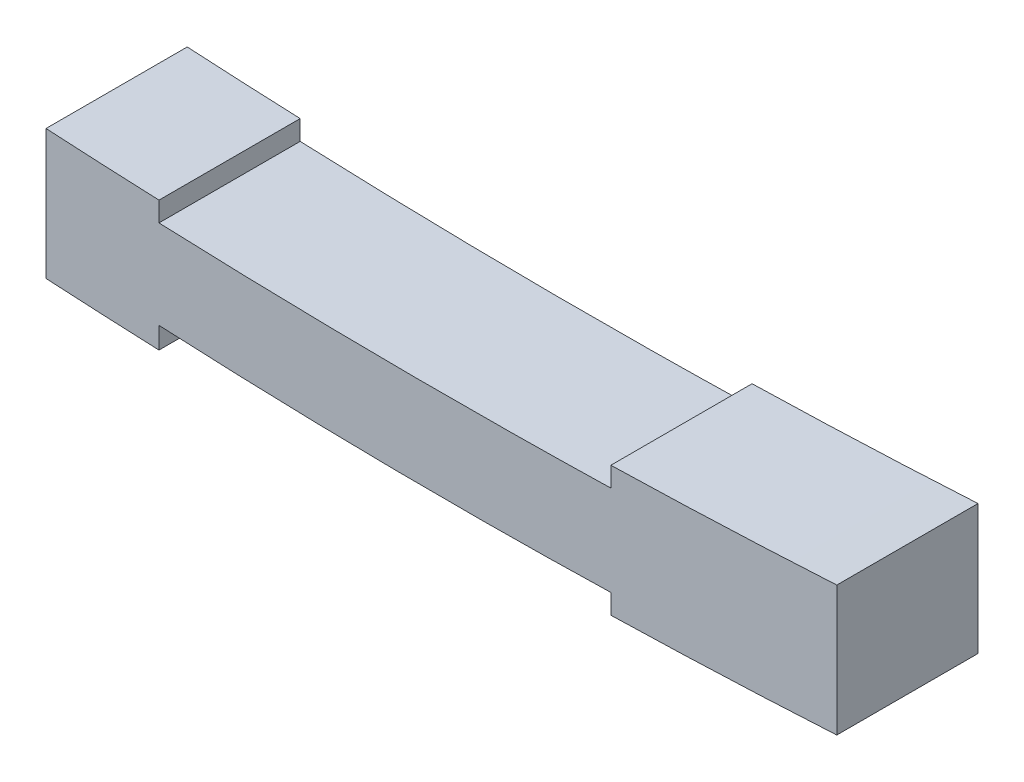
ISO-10303-21;
HEADER;
FILE_DESCRIPTION(('STEP AP214'),'2;1');
FILE_NAME('part.step','',(''),(''),'','','');
FILE_SCHEMA(('AUTOMOTIVE_DESIGN { 1 0 10303 214 1 1 1 1 }'));
ENDSEC;
DATA;
#1=APPLICATION_CONTEXT('core data for automotive mechanical design processes');
#2=APPLICATION_PROTOCOL_DEFINITION('international standard','automotive_design',2000,#1);
#3=PRODUCT_CONTEXT('',#1,'mechanical');
#4=PRODUCT('Part','Part','',(#3));
#5=PRODUCT_RELATED_PRODUCT_CATEGORY('part','',(#4));
#6=PRODUCT_DEFINITION_FORMATION('','',#4);
#7=PRODUCT_DEFINITION_CONTEXT('part definition',#1,'design');
#8=PRODUCT_DEFINITION('design','',#6,#7);
#9=PRODUCT_DEFINITION_SHAPE('','',#8);
#10=(LENGTH_UNIT() NAMED_UNIT(*) SI_UNIT(.MILLI.,.METRE.));
#11=(NAMED_UNIT(*) PLANE_ANGLE_UNIT() SI_UNIT($,.RADIAN.));
#12=(NAMED_UNIT(*) SI_UNIT($,.STERADIAN.) SOLID_ANGLE_UNIT());
#13=UNCERTAINTY_MEASURE_WITH_UNIT(LENGTH_MEASURE(1.E-05),#10,'distance_accuracy_value','');
#14=(GEOMETRIC_REPRESENTATION_CONTEXT(3) GLOBAL_UNCERTAINTY_ASSIGNED_CONTEXT((#13)) GLOBAL_UNIT_ASSIGNED_CONTEXT((#10,
#11,#12)) REPRESENTATION_CONTEXT('',''));
#15=CARTESIAN_POINT('',(0.,0.,0.));
#16=DIRECTION('',(0.,0.,1.));
#17=DIRECTION('',(1.,0.,0.));
#18=AXIS2_PLACEMENT_3D('',#15,#16,#17);
#19=CARTESIAN_POINT('',(-70.,25.,12.5));
#20=DIRECTION('',(1.,0.,0.));
#21=DIRECTION('',(0.,0.,-1.));
#22=AXIS2_PLACEMENT_3D('',#19,#20,#21);
#23=PLANE('',#22);
#24=DIRECTION('',(0.,0.,1.));
#25=VECTOR('',#24,1.);
#26=CARTESIAN_POINT('',(-70.,2.,-12.5));
#27=LINE('',#26,#25);
#28=CARTESIAN_POINT('',(-70.,2.,-12.5));
#29=VERTEX_POINT('',#28);
#30=CARTESIAN_POINT('',(-70.,2.,12.5));
#31=VERTEX_POINT('',#30);
#32=EDGE_CURVE('E259',#29,#31,#27,.T.);
#33=ORIENTED_EDGE('',*,*,#32,.T.);
#34=DIRECTION('',(0.,-1.,0.));
#35=VECTOR('',#34,1.);
#36=CARTESIAN_POINT('',(-70.,25.,12.5));
#37=LINE('',#36,#35);
#38=CARTESIAN_POINT('',(-70.,25.,12.5));
#39=VERTEX_POINT('',#38);
#40=EDGE_CURVE('E11',#39,#31,#37,.T.);
#41=ORIENTED_EDGE('',*,*,#40,.F.);
#42=DIRECTION('',(0.,0.,1.));
#43=VECTOR('',#42,1.);
#44=CARTESIAN_POINT('',(-70.,25.,12.5));
#45=LINE('',#44,#43);
#46=CARTESIAN_POINT('',(-70.,25.,-12.5));
#47=VERTEX_POINT('',#46);
#48=EDGE_CURVE('E212',#47,#39,#45,.T.);
#49=ORIENTED_EDGE('',*,*,#48,.F.);
#50=DIRECTION('',(0.,-1.,0.));
#51=VECTOR('',#50,1.);
#52=CARTESIAN_POINT('',(-70.,25.,-12.5));
#53=LINE('',#52,#51);
#54=EDGE_CURVE('E221',#47,#29,#53,.T.);
#55=ORIENTED_EDGE('',*,*,#54,.T.);
#56=EDGE_LOOP('',(#33,#41,#49,#55));
#57=FACE_BOUND('',#56,.T.);
#58=ADVANCED_FACE('F32',(#57),#23,.F.);
#59=CARTESIAN_POINT('',(70.,25.,12.5));
#60=DIRECTION('',(0.,0.,-1.));
#61=DIRECTION('',(-1.,0.,0.));
#62=AXIS2_PLACEMENT_3D('',#59,#60,#61);
#63=PLANE('',#62);
#64=CARTESIAN_POINT('',(-70.,2.,12.5));
#65=CARTESIAN_POINT('',(0.,-2.,12.5));
#66=CARTESIAN_POINT('',(70.,2.,12.5));
#67=B_SPLINE_CURVE_WITH_KNOTS('',2,(#64,#65,#66),.UNSPECIFIED.,.F.,.F.,(3,3),(0.,1.),.UNSPECIFIED.);
#68=CARTESIAN_POINT('',(30.,0.36734693877551,12.5));
#69=VERTEX_POINT('',#68);
#70=CARTESIAN_POINT('',(70.,2.,12.5));
#71=VERTEX_POINT('',#70);
#72=EDGE_CURVE('E144',#69,#71,#67,.T.);
#73=ORIENTED_EDGE('',*,*,#72,.T.);
#74=DIRECTION('',(0.,-1.,0.));
#75=VECTOR('',#74,1.);
#76=CARTESIAN_POINT('',(70.,25.,12.5));
#77=LINE('',#76,#75);
#78=CARTESIAN_POINT('',(70.,25.,12.5));
#79=VERTEX_POINT('',#78);
#80=EDGE_CURVE('E39',#79,#71,#77,.T.);
#81=ORIENTED_EDGE('',*,*,#80,.F.);
#82=CARTESIAN_POINT('',(-70.,25.,12.5));
#83=CARTESIAN_POINT('',(0.,21.,12.5));
#84=CARTESIAN_POINT('',(70.,25.,12.5));
#85=B_SPLINE_CURVE_WITH_KNOTS('',2,(#82,#83,#84),.UNSPECIFIED.,.F.,.F.,(3,3),(0.,1.),.UNSPECIFIED.);
#86=CARTESIAN_POINT('',(30.,23.3673469387755,12.5));
#87=VERTEX_POINT('',#86);
#88=EDGE_CURVE('E203',#87,#79,#85,.T.);
#89=ORIENTED_EDGE('',*,*,#88,.F.);
#90=DIRECTION('',(0.,-1.,0.));
#91=VECTOR('',#90,1.);
#92=CARTESIAN_POINT('',(30.,0.,12.5));
#93=LINE('',#92,#91);
#94=CARTESIAN_POINT('',(30.,19.8673469387755,12.5));
#95=VERTEX_POINT('',#94);
#96=EDGE_CURVE('E197',#87,#95,#93,.T.);
#97=ORIENTED_EDGE('',*,*,#96,.T.);
#98=CARTESIAN_POINT('',(-50.,20.5204081632653,12.5));
#99=CARTESIAN_POINT('',(-10.0053296914234,18.8877550966062,12.5));
#100=CARTESIAN_POINT('',(30.,19.8673469387755,12.5));
#101=B_SPLINE_CURVE_WITH_KNOTS('',2,(#98,#99,#100),.UNSPECIFIED.,.F.,.F.,(3,3),(0.,1.),.UNSPECIFIED.);
#102=CARTESIAN_POINT('',(-50.,20.5204081632653,12.5));
#103=VERTEX_POINT('',#102);
#104=EDGE_CURVE('E192',#103,#95,#101,.T.);
#105=ORIENTED_EDGE('',*,*,#104,.F.);
#106=DIRECTION('',(0.,-1.,0.));
#107=VECTOR('',#106,1.);
#108=CARTESIAN_POINT('',(-50.,0.,12.5));
#109=LINE('',#108,#107);
#110=CARTESIAN_POINT('',(-50.,24.0204081632653,12.5));
#111=VERTEX_POINT('',#110);
#112=EDGE_CURVE('E185',#111,#103,#109,.T.);
#113=ORIENTED_EDGE('',*,*,#112,.F.);
#114=CARTESIAN_POINT('',(-70.,25.,12.5));
#115=CARTESIAN_POINT('',(0.,21.,12.5));
#116=CARTESIAN_POINT('',(70.,25.,12.5));
#117=B_SPLINE_CURVE_WITH_KNOTS('',2,(#114,#115,#116),.UNSPECIFIED.,.F.,.F.,(3,3),(0.,1.),.UNSPECIFIED.);
#118=EDGE_CURVE('E177',#39,#111,#117,.T.);
#119=ORIENTED_EDGE('',*,*,#118,.F.);
#120=ORIENTED_EDGE('',*,*,#40,.T.);
#121=CARTESIAN_POINT('',(-70.,2.,12.5));
#122=CARTESIAN_POINT('',(0.,-2.,12.5));
#123=CARTESIAN_POINT('',(70.,2.,12.5));
#124=B_SPLINE_CURVE_WITH_KNOTS('',2,(#121,#122,#123),.UNSPECIFIED.,.F.,.F.,(3,3),(0.,1.),.UNSPECIFIED.);
#125=CARTESIAN_POINT('',(-50.,1.02040816326531,12.5));
#126=VERTEX_POINT('',#125);
#127=EDGE_CURVE('E241',#31,#126,#124,.T.);
#128=ORIENTED_EDGE('',*,*,#127,.T.);
#129=DIRECTION('',(0.,-1.,0.));
#130=VECTOR('',#129,1.);
#131=CARTESIAN_POINT('',(-50.,0.,12.5));
#132=LINE('',#131,#130);
#133=CARTESIAN_POINT('',(-50.,4.81303337381789,12.5));
#134=VERTEX_POINT('',#133);
#135=EDGE_CURVE('E244',#134,#126,#132,.T.);
#136=ORIENTED_EDGE('',*,*,#135,.F.);
#137=CARTESIAN_POINT('',(-50.,4.81303337381789,12.5));
#138=CARTESIAN_POINT('',(-10.0107895376873,2.79999119229216,12.5));
#139=CARTESIAN_POINT('',(30.,3.86734693877551,12.5));
#140=B_SPLINE_CURVE_WITH_KNOTS('',2,(#137,#138,#139),.UNSPECIFIED.,.F.,.F.,(3,3),(0.,1.),.UNSPECIFIED.);
#141=CARTESIAN_POINT('',(30.,3.86734693877551,12.5));
#142=VERTEX_POINT('',#141);
#143=EDGE_CURVE('E127',#134,#142,#140,.T.);
#144=ORIENTED_EDGE('',*,*,#143,.T.);
#145=DIRECTION('',(0.,-1.,0.));
#146=VECTOR('',#145,1.);
#147=CARTESIAN_POINT('',(30.,0.,12.5));
#148=LINE('',#147,#146);
#149=EDGE_CURVE('E141',#142,#69,#148,.T.);
#150=ORIENTED_EDGE('',*,*,#149,.T.);
#151=EDGE_LOOP('',(#73,#81,#89,#97,#105,#113,#119,#120,#128,#136,#144,#150));
#152=FACE_BOUND('',#151,.T.);
#153=ADVANCED_FACE('F237',(#152),#63,.F.);
#154=CARTESIAN_POINT('',(70.,25.,12.5));
#155=DIRECTION('',(-1.,0.,0.));
#156=DIRECTION('',(0.,0.,1.));
#157=AXIS2_PLACEMENT_3D('',#154,#155,#156);
#158=PLANE('',#157);
#159=DIRECTION('',(0.,0.,1.));
#160=VECTOR('',#159,1.);
#161=CARTESIAN_POINT('',(70.,2.,-12.5));
#162=LINE('',#161,#160);
#163=CARTESIAN_POINT('',(70.,2.,-12.5));
#164=VERTEX_POINT('',#163);
#165=EDGE_CURVE('E233',#164,#71,#162,.T.);
#166=ORIENTED_EDGE('',*,*,#165,.F.);
#167=DIRECTION('',(0.,-1.,0.));
#168=VECTOR('',#167,1.);
#169=CARTESIAN_POINT('',(70.,25.,-12.5));
#170=LINE('',#169,#168);
#171=CARTESIAN_POINT('',(70.,25.,-12.5));
#172=VERTEX_POINT('',#171);
#173=EDGE_CURVE('E224',#172,#164,#170,.T.);
#174=ORIENTED_EDGE('',*,*,#173,.F.);
#175=DIRECTION('',(0.,0.,-1.));
#176=VECTOR('',#175,1.);
#177=CARTESIAN_POINT('',(70.,25.,12.5));
#178=LINE('',#177,#176);
#179=EDGE_CURVE('E219',#79,#172,#178,.T.);
#180=ORIENTED_EDGE('',*,*,#179,.F.);
#181=ORIENTED_EDGE('',*,*,#80,.T.);
#182=EDGE_LOOP('',(#166,#174,#180,#181));
#183=FACE_BOUND('',#182,.T.);
#184=ADVANCED_FACE('F231',(#183),#158,.F.);
#185=CARTESIAN_POINT('',(70.,25.,-12.5));
#186=DIRECTION('',(0.,0.,1.));
#187=DIRECTION('',(1.,0.,0.));
#188=AXIS2_PLACEMENT_3D('',#185,#186,#187);
#189=PLANE('',#188);
#190=CARTESIAN_POINT('',(-70.,2.,-12.5));
#191=CARTESIAN_POINT('',(0.,-2.,-12.5));
#192=CARTESIAN_POINT('',(70.,2.,-12.5));
#193=B_SPLINE_CURVE_WITH_KNOTS('',2,(#190,#191,#192),.UNSPECIFIED.,.F.,.F.,(3,3),(0.,1.),.UNSPECIFIED.);
#194=CARTESIAN_POINT('',(30.,0.36734693877551,-12.5));
#195=VERTEX_POINT('',#194);
#196=EDGE_CURVE('E298',#195,#164,#193,.T.);
#197=ORIENTED_EDGE('',*,*,#196,.F.);
#198=DIRECTION('',(0.,-1.,0.));
#199=VECTOR('',#198,1.);
#200=CARTESIAN_POINT('',(30.,0.,-12.5));
#201=LINE('',#200,#199);
#202=CARTESIAN_POINT('',(30.,3.86734693877551,-12.5));
#203=VERTEX_POINT('',#202);
#204=EDGE_CURVE('E129',#203,#195,#201,.T.);
#205=ORIENTED_EDGE('',*,*,#204,.F.);
#206=CARTESIAN_POINT('',(-50.,4.81303337381789,-12.5));
#207=CARTESIAN_POINT('',(-10.0107895376873,2.79999119229216,-12.5));
#208=CARTESIAN_POINT('',(30.,3.86734693877551,-12.5));
#209=B_SPLINE_CURVE_WITH_KNOTS('',2,(#206,#207,#208),.UNSPECIFIED.,.F.,.F.,(3,3),(0.,1.),.UNSPECIFIED.);
#210=CARTESIAN_POINT('',(-50.,4.81303337381789,-12.5));
#211=VERTEX_POINT('',#210);
#212=EDGE_CURVE('E124',#211,#203,#209,.T.);
#213=ORIENTED_EDGE('',*,*,#212,.F.);
#214=DIRECTION('',(0.,-1.,0.));
#215=VECTOR('',#214,1.);
#216=CARTESIAN_POINT('',(-50.,0.,-12.5));
#217=LINE('',#216,#215);
#218=CARTESIAN_POINT('',(-50.,1.0204081632653,-12.5));
#219=VERTEX_POINT('',#218);
#220=EDGE_CURVE('E132',#211,#219,#217,.T.);
#221=ORIENTED_EDGE('',*,*,#220,.T.);
#222=CARTESIAN_POINT('',(-70.,2.,-12.5));
#223=CARTESIAN_POINT('',(0.,-2.,-12.5));
#224=CARTESIAN_POINT('',(70.,2.,-12.5));
#225=B_SPLINE_CURVE_WITH_KNOTS('',2,(#222,#223,#224),.UNSPECIFIED.,.F.,.F.,(3,3),(0.,1.),.UNSPECIFIED.);
#226=EDGE_CURVE('E136',#29,#219,#225,.T.);
#227=ORIENTED_EDGE('',*,*,#226,.F.);
#228=ORIENTED_EDGE('',*,*,#54,.F.);
#229=CARTESIAN_POINT('',(-70.,25.,-12.5));
#230=CARTESIAN_POINT('',(0.,21.,-12.5));
#231=CARTESIAN_POINT('',(70.,25.,-12.5));
#232=B_SPLINE_CURVE_WITH_KNOTS('',2,(#229,#230,#231),.UNSPECIFIED.,.F.,.F.,(3,3),(0.,1.),.UNSPECIFIED.);
#233=CARTESIAN_POINT('',(-50.,24.0204081632653,-12.5));
#234=VERTEX_POINT('',#233);
#235=EDGE_CURVE('E54',#47,#234,#232,.T.);
#236=ORIENTED_EDGE('',*,*,#235,.T.);
#237=DIRECTION('',(0.,-1.,0.));
#238=VECTOR('',#237,1.);
#239=CARTESIAN_POINT('',(-50.,0.,-12.5));
#240=LINE('',#239,#238);
#241=CARTESIAN_POINT('',(-50.,20.5204081632653,-12.5));
#242=VERTEX_POINT('',#241);
#243=EDGE_CURVE('E267',#234,#242,#240,.T.);
#244=ORIENTED_EDGE('',*,*,#243,.T.);
#245=CARTESIAN_POINT('',(-50.,20.5204081632653,-12.5));
#246=CARTESIAN_POINT('',(-10.0053296914234,18.8877550966062,-12.5));
#247=CARTESIAN_POINT('',(30.,19.8673469387755,-12.5));
#248=B_SPLINE_CURVE_WITH_KNOTS('',2,(#245,#246,#247),.UNSPECIFIED.,.F.,.F.,(3,3),(0.,1.),.UNSPECIFIED.);
#249=CARTESIAN_POINT('',(30.,19.8673469387755,-12.5));
#250=VERTEX_POINT('',#249);
#251=EDGE_CURVE('E297',#242,#250,#248,.T.);
#252=ORIENTED_EDGE('',*,*,#251,.T.);
#253=DIRECTION('',(0.,-1.,0.));
#254=VECTOR('',#253,1.);
#255=CARTESIAN_POINT('',(30.,0.,-12.5));
#256=LINE('',#255,#254);
#257=CARTESIAN_POINT('',(30.,23.3673469387755,-12.5));
#258=VERTEX_POINT('',#257);
#259=EDGE_CURVE('E175',#258,#250,#256,.T.);
#260=ORIENTED_EDGE('',*,*,#259,.F.);
#261=CARTESIAN_POINT('',(-70.,25.,-12.5));
#262=CARTESIAN_POINT('',(0.,21.,-12.5));
#263=CARTESIAN_POINT('',(70.,25.,-12.5));
#264=B_SPLINE_CURVE_WITH_KNOTS('',2,(#261,#262,#263),.UNSPECIFIED.,.F.,.F.,(3,3),(0.,1.),.UNSPECIFIED.);
#265=EDGE_CURVE('E167',#258,#172,#264,.T.);
#266=ORIENTED_EDGE('',*,*,#265,.T.);
#267=ORIENTED_EDGE('',*,*,#173,.T.);
#268=EDGE_LOOP('',(#197,#205,#213,#221,#227,#228,#236,#244,#252,#260,#266,#267));
#269=FACE_BOUND('',#268,.T.);
#270=ADVANCED_FACE('F140',(#269),#189,.F.);
#271=DIRECTION('',(0.,0.,1.));
#272=VECTOR('',#271,1.);
#273=SURFACE_OF_LINEAR_EXTRUSION('',#264,#272);
#274=ORIENTED_EDGE('',*,*,#88,.T.);
#275=ORIENTED_EDGE('',*,*,#179,.T.);
#276=ORIENTED_EDGE('',*,*,#265,.F.);
#277=DIRECTION('',(0.,0.,1.));
#278=VECTOR('',#277,1.);
#279=CARTESIAN_POINT('',(30.,23.3673469387755,-12.5));
#280=LINE('',#279,#278);
#281=EDGE_CURVE('E207',#258,#87,#280,.T.);
#282=ORIENTED_EDGE('',*,*,#281,.T.);
#283=EDGE_LOOP('',(#274,#275,#276,#282));
#284=FACE_BOUND('',#283,.T.);
#285=ADVANCED_FACE('F160',(#284),#273,.F.);
#286=CARTESIAN_POINT('',(30.,0.,-12.5));
#287=DIRECTION('',(-1.,0.,0.));
#288=DIRECTION('',(0.,-1.,0.));
#289=AXIS2_PLACEMENT_3D('',#286,#287,#288);
#290=PLANE('',#289);
#291=ORIENTED_EDGE('',*,*,#96,.F.);
#292=ORIENTED_EDGE('',*,*,#281,.F.);
#293=ORIENTED_EDGE('',*,*,#259,.T.);
#294=DIRECTION('',(0.,0.,1.));
#295=VECTOR('',#294,1.);
#296=CARTESIAN_POINT('',(30.,19.8673469387755,-12.5));
#297=LINE('',#296,#295);
#298=EDGE_CURVE('E213',#250,#95,#297,.T.);
#299=ORIENTED_EDGE('',*,*,#298,.T.);
#300=EDGE_LOOP('',(#291,#292,#293,#299));
#301=FACE_BOUND('',#300,.T.);
#302=ADVANCED_FACE('F164',(#301),#290,.T.);
#303=DIRECTION('',(0.,0.,1.));
#304=VECTOR('',#303,1.);
#305=SURFACE_OF_LINEAR_EXTRUSION('',#248,#304);
#306=ORIENTED_EDGE('',*,*,#104,.T.);
#307=ORIENTED_EDGE('',*,*,#298,.F.);
#308=ORIENTED_EDGE('',*,*,#251,.F.);
#309=DIRECTION('',(0.,0.,1.));
#310=VECTOR('',#309,1.);
#311=CARTESIAN_POINT('',(-50.,20.5204081632653,-12.5));
#312=LINE('',#311,#310);
#313=EDGE_CURVE('E215',#242,#103,#312,.T.);
#314=ORIENTED_EDGE('',*,*,#313,.T.);
#315=EDGE_LOOP('',(#306,#307,#308,#314));
#316=FACE_BOUND('',#315,.T.);
#317=ADVANCED_FACE('F332',(#316),#305,.F.);
#318=CARTESIAN_POINT('',(-50.,0.,-12.5));
#319=DIRECTION('',(-1.,0.,0.));
#320=DIRECTION('',(0.,0.,1.));
#321=AXIS2_PLACEMENT_3D('',#318,#319,#320);
#322=PLANE('',#321);
#323=ORIENTED_EDGE('',*,*,#112,.T.);
#324=ORIENTED_EDGE('',*,*,#313,.F.);
#325=ORIENTED_EDGE('',*,*,#243,.F.);
#326=DIRECTION('',(0.,0.,1.));
#327=VECTOR('',#326,1.);
#328=CARTESIAN_POINT('',(-50.,24.0204081632653,-12.5));
#329=LINE('',#328,#327);
#330=EDGE_CURVE('E174',#234,#111,#329,.T.);
#331=ORIENTED_EDGE('',*,*,#330,.T.);
#332=EDGE_LOOP('',(#323,#324,#325,#331));
#333=FACE_BOUND('',#332,.T.);
#334=ADVANCED_FACE('F275',(#333),#322,.F.);
#335=DIRECTION('',(0.,0.,1.));
#336=VECTOR('',#335,1.);
#337=SURFACE_OF_LINEAR_EXTRUSION('',#232,#336);
#338=ORIENTED_EDGE('',*,*,#118,.T.);
#339=ORIENTED_EDGE('',*,*,#330,.F.);
#340=ORIENTED_EDGE('',*,*,#235,.F.);
#341=ORIENTED_EDGE('',*,*,#48,.T.);
#342=EDGE_LOOP('',(#338,#339,#340,#341));
#343=FACE_BOUND('',#342,.T.);
#344=ADVANCED_FACE('F158',(#343),#337,.F.);
#345=DIRECTION('',(0.,0.,1.));
#346=VECTOR('',#345,1.);
#347=SURFACE_OF_LINEAR_EXTRUSION('',#209,#346);
#348=ORIENTED_EDGE('',*,*,#143,.F.);
#349=DIRECTION('',(0.,0.,1.));
#350=VECTOR('',#349,1.);
#351=CARTESIAN_POINT('',(-50.,4.81303337381789,-12.5));
#352=LINE('',#351,#350);
#353=EDGE_CURVE('E120',#211,#134,#352,.T.);
#354=ORIENTED_EDGE('',*,*,#353,.F.);
#355=ORIENTED_EDGE('',*,*,#212,.T.);
#356=DIRECTION('',(0.,0.,1.));
#357=VECTOR('',#356,1.);
#358=CARTESIAN_POINT('',(30.,3.86734693877551,-12.5));
#359=LINE('',#358,#357);
#360=EDGE_CURVE('E186',#203,#142,#359,.T.);
#361=ORIENTED_EDGE('',*,*,#360,.T.);
#362=EDGE_LOOP('',(#348,#354,#355,#361));
#363=FACE_BOUND('',#362,.T.);
#364=ADVANCED_FACE('F121',(#363),#347,.T.);
#365=CARTESIAN_POINT('',(30.,0.,-12.5));
#366=DIRECTION('',(-1.,0.,0.));
#367=DIRECTION('',(0.,-1.,0.));
#368=AXIS2_PLACEMENT_3D('',#365,#366,#367);
#369=PLANE('',#368);
#370=ORIENTED_EDGE('',*,*,#149,.F.);
#371=ORIENTED_EDGE('',*,*,#360,.F.);
#372=ORIENTED_EDGE('',*,*,#204,.T.);
#373=DIRECTION('',(0.,0.,1.));
#374=VECTOR('',#373,1.);
#375=CARTESIAN_POINT('',(30.,0.36734693877551,-12.5));
#376=LINE('',#375,#374);
#377=EDGE_CURVE('E256',#195,#69,#376,.T.);
#378=ORIENTED_EDGE('',*,*,#377,.T.);
#379=EDGE_LOOP('',(#370,#371,#372,#378));
#380=FACE_BOUND('',#379,.T.);
#381=ADVANCED_FACE('F157',(#380),#369,.T.);
#382=DIRECTION('',(0.,0.,1.));
#383=VECTOR('',#382,1.);
#384=SURFACE_OF_LINEAR_EXTRUSION('',#193,#383);
#385=ORIENTED_EDGE('',*,*,#72,.F.);
#386=ORIENTED_EDGE('',*,*,#377,.F.);
#387=ORIENTED_EDGE('',*,*,#196,.T.);
#388=ORIENTED_EDGE('',*,*,#165,.T.);
#389=EDGE_LOOP('',(#385,#386,#387,#388));
#390=FACE_BOUND('',#389,.T.);
#391=ADVANCED_FACE('F313',(#390),#384,.T.);
#392=DIRECTION('',(0.,0.,1.));
#393=VECTOR('',#392,1.);
#394=SURFACE_OF_LINEAR_EXTRUSION('',#225,#393);
#395=ORIENTED_EDGE('',*,*,#127,.F.);
#396=ORIENTED_EDGE('',*,*,#32,.F.);
#397=ORIENTED_EDGE('',*,*,#226,.T.);
#398=DIRECTION('',(0.,0.,1.));
#399=VECTOR('',#398,1.);
#400=CARTESIAN_POINT('',(-50.,1.02040816326531,-12.5));
#401=LINE('',#400,#399);
#402=EDGE_CURVE('E46',#219,#126,#401,.T.);
#403=ORIENTED_EDGE('',*,*,#402,.T.);
#404=EDGE_LOOP('',(#395,#396,#397,#403));
#405=FACE_BOUND('',#404,.T.);
#406=ADVANCED_FACE('F310',(#405),#394,.T.);
#407=CARTESIAN_POINT('',(-50.,0.,-12.5));
#408=DIRECTION('',(-1.,0.,0.));
#409=DIRECTION('',(0.,0.,1.));
#410=AXIS2_PLACEMENT_3D('',#407,#408,#409);
#411=PLANE('',#410);
#412=ORIENTED_EDGE('',*,*,#135,.T.);
#413=ORIENTED_EDGE('',*,*,#402,.F.);
#414=ORIENTED_EDGE('',*,*,#220,.F.);
#415=ORIENTED_EDGE('',*,*,#353,.T.);
#416=EDGE_LOOP('',(#412,#413,#414,#415));
#417=FACE_BOUND('',#416,.T.);
#418=ADVANCED_FACE('F133',(#417),#411,.F.);
#419=CLOSED_SHELL('',(#58,#153,#184,#270,#285,#302,#317,#334,#344,#364,#381,#391,#406,#418));
#420=MANIFOLD_SOLID_BREP('B2',#419);
#421=ADVANCED_BREP_SHAPE_REPRESENTATION('',(#18,#420),#14);
#422=SHAPE_DEFINITION_REPRESENTATION(#9,#421);
ENDSEC;
END-ISO-10303-21;
